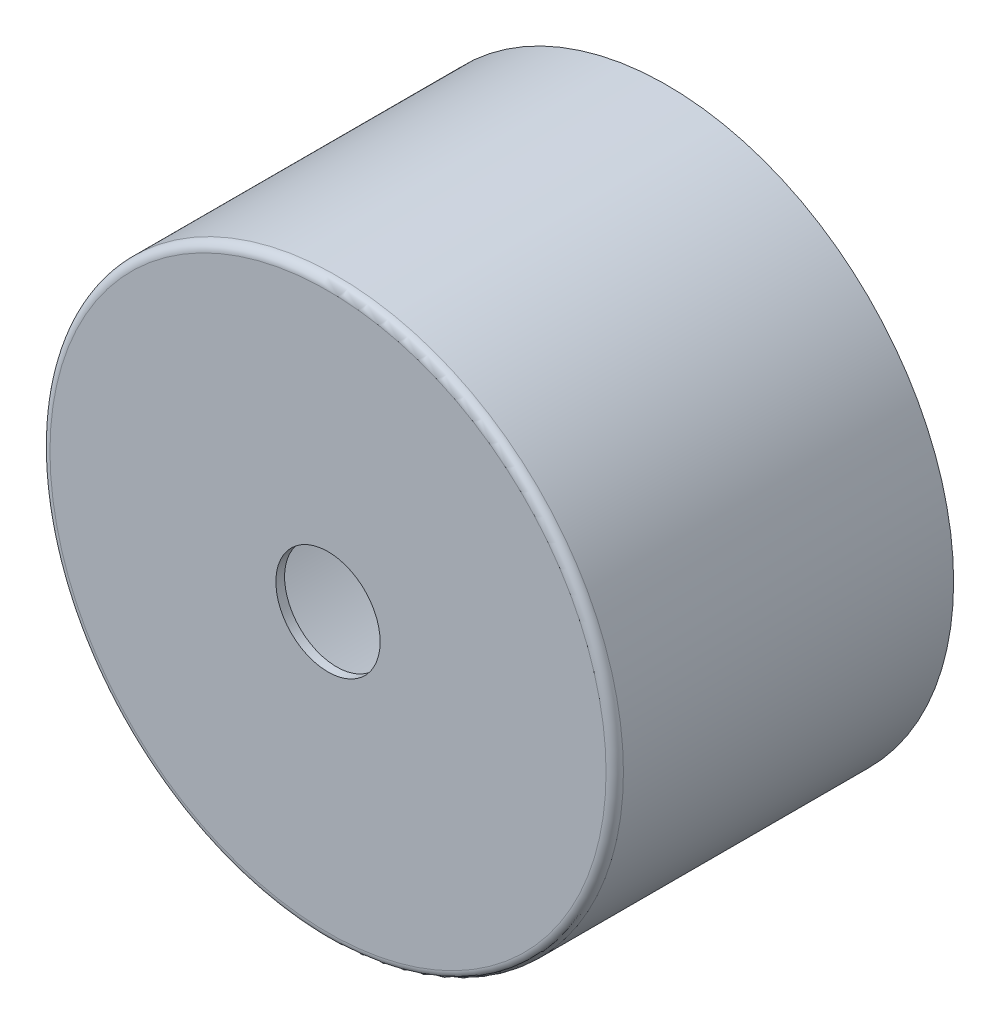
ISO-10303-21;
HEADER;
FILE_DESCRIPTION(('STEP AP214'),'2;1');
FILE_NAME('part.step','',(''),(''),'','','');
FILE_SCHEMA(('AUTOMOTIVE_DESIGN { 1 0 10303 214 1 1 1 1 }'));
ENDSEC;
DATA;
#1=APPLICATION_CONTEXT('core data for automotive mechanical design processes');
#2=APPLICATION_PROTOCOL_DEFINITION('international standard','automotive_design',2000,#1);
#3=PRODUCT_CONTEXT('',#1,'mechanical');
#4=PRODUCT('Part','Part','',(#3));
#5=PRODUCT_RELATED_PRODUCT_CATEGORY('part','',(#4));
#6=PRODUCT_DEFINITION_FORMATION('','',#4);
#7=PRODUCT_DEFINITION_CONTEXT('part definition',#1,'design');
#8=PRODUCT_DEFINITION('design','',#6,#7);
#9=PRODUCT_DEFINITION_SHAPE('','',#8);
#10=(LENGTH_UNIT() NAMED_UNIT(*) SI_UNIT(.MILLI.,.METRE.));
#11=(NAMED_UNIT(*) PLANE_ANGLE_UNIT() SI_UNIT($,.RADIAN.));
#12=(NAMED_UNIT(*) SI_UNIT($,.STERADIAN.) SOLID_ANGLE_UNIT());
#13=UNCERTAINTY_MEASURE_WITH_UNIT(LENGTH_MEASURE(1.E-05),#10,'distance_accuracy_value','');
#14=(GEOMETRIC_REPRESENTATION_CONTEXT(3) GLOBAL_UNCERTAINTY_ASSIGNED_CONTEXT((#13)) GLOBAL_UNIT_ASSIGNED_CONTEXT((#10,
#11,#12)) REPRESENTATION_CONTEXT('',''));
#15=CARTESIAN_POINT('',(0.,0.,0.));
#16=DIRECTION('',(0.,0.,1.));
#17=DIRECTION('',(1.,0.,0.));
#18=AXIS2_PLACEMENT_3D('',#15,#16,#17);
#19=CARTESIAN_POINT('',(0.,0.,-19.5));
#20=DIRECTION('',(0.,0.,1.));
#21=DIRECTION('',(1.,0.,0.));
#22=AXIS2_PLACEMENT_3D('',#19,#20,#21);
#23=CYLINDRICAL_SURFACE('',#22,16.5);
#24=CARTESIAN_POINT('',(0.,0.,-0.5));
#25=DIRECTION('',(0.,0.,1.));
#26=DIRECTION('',(1.,0.,0.));
#27=AXIS2_PLACEMENT_3D('',#24,#25,#26);
#28=CIRCLE('',#27,16.5);
#29=CARTESIAN_POINT('',(16.5,0.,-0.5));
#30=VERTEX_POINT('',#29);
#31=EDGE_CURVE('E10',#30,#30,#28,.F.);
#32=ORIENTED_EDGE('',*,*,#31,.T.);
#33=EDGE_LOOP('',(#32));
#34=FACE_BOUND('',#33,.T.);
#35=CARTESIAN_POINT('',(0.,0.,-19.5));
#36=DIRECTION('',(0.,0.,1.));
#37=DIRECTION('',(1.,0.,0.));
#38=AXIS2_PLACEMENT_3D('',#35,#36,#37);
#39=CIRCLE('',#38,16.5);
#40=CARTESIAN_POINT('',(16.5,0.,-19.5));
#41=VERTEX_POINT('',#40);
#42=EDGE_CURVE('E41',#41,#41,#39,.T.);
#43=ORIENTED_EDGE('',*,*,#42,.T.);
#44=EDGE_LOOP('',(#43));
#45=FACE_BOUND('',#44,.T.);
#46=ADVANCED_FACE('F30',(#34,#45),#23,.T.);
#47=CARTESIAN_POINT('',(0.,0.,-19.5));
#48=DIRECTION('',(0.,0.,1.));
#49=DIRECTION('',(1.,0.,0.));
#50=AXIS2_PLACEMENT_3D('',#47,#48,#49);
#51=PLANE('',#50);
#52=CARTESIAN_POINT('',(0.,0.,-19.5));
#53=DIRECTION('',(0.,0.,1.));
#54=DIRECTION('',(1.,0.,0.));
#55=AXIS2_PLACEMENT_3D('',#52,#53,#54);
#56=CIRCLE('',#55,16.);
#57=CARTESIAN_POINT('',(16.,0.,-19.5));
#58=VERTEX_POINT('',#57);
#59=EDGE_CURVE('E45',#58,#58,#56,.T.);
#60=ORIENTED_EDGE('',*,*,#59,.T.);
#61=EDGE_LOOP('',(#60));
#62=FACE_BOUND('',#61,.T.);
#63=ORIENTED_EDGE('',*,*,#42,.F.);
#64=EDGE_LOOP('',(#63));
#65=FACE_BOUND('',#64,.T.);
#66=ADVANCED_FACE('F66',(#62,#65),#51,.F.);
#67=CARTESIAN_POINT('',(0.,0.,0.));
#68=DIRECTION('',(0.,0.,1.));
#69=DIRECTION('',(1.,0.,0.));
#70=AXIS2_PLACEMENT_3D('',#67,#68,#69);
#71=PLANE('',#70);
#72=CARTESIAN_POINT('',(0.,0.,0.));
#73=DIRECTION('',(0.,0.,1.));
#74=DIRECTION('',(1.,0.,0.));
#75=AXIS2_PLACEMENT_3D('',#72,#73,#74);
#76=CIRCLE('',#75,16.);
#77=CARTESIAN_POINT('',(16.,0.,0.));
#78=VERTEX_POINT('',#77);
#79=EDGE_CURVE('E37',#78,#78,#76,.T.);
#80=ORIENTED_EDGE('',*,*,#79,.T.);
#81=EDGE_LOOP('',(#80));
#82=FACE_BOUND('',#81,.T.);
#83=CARTESIAN_POINT('',(0.,0.,0.));
#84=DIRECTION('',(0.,0.,1.));
#85=DIRECTION('',(1.,0.,0.));
#86=AXIS2_PLACEMENT_3D('',#83,#84,#85);
#87=CIRCLE('',#86,3.);
#88=CARTESIAN_POINT('',(3.,0.,0.));
#89=VERTEX_POINT('',#88);
#90=EDGE_CURVE('E51',#89,#89,#87,.T.);
#91=ORIENTED_EDGE('',*,*,#90,.F.);
#92=EDGE_LOOP('',(#91));
#93=FACE_BOUND('',#92,.T.);
#94=ADVANCED_FACE('F63',(#82,#93),#71,.T.);
#95=CARTESIAN_POINT('',(0.,0.,-19.5));
#96=DIRECTION('',(0.,0.,1.));
#97=DIRECTION('',(1.,0.,0.));
#98=AXIS2_PLACEMENT_3D('',#95,#96,#97);
#99=CYLINDRICAL_SURFACE('',#98,16.);
#100=ORIENTED_EDGE('',*,*,#59,.F.);
#101=EDGE_LOOP('',(#100));
#102=FACE_BOUND('',#101,.T.);
#103=CARTESIAN_POINT('',(0.,0.,-0.5));
#104=DIRECTION('',(0.,0.,1.));
#105=DIRECTION('',(1.,0.,0.));
#106=AXIS2_PLACEMENT_3D('',#103,#104,#105);
#107=CIRCLE('',#106,16.);
#108=CARTESIAN_POINT('',(16.,0.,-0.5));
#109=VERTEX_POINT('',#108);
#110=EDGE_CURVE('E50',#109,#109,#107,.T.);
#111=ORIENTED_EDGE('',*,*,#110,.T.);
#112=EDGE_LOOP('',(#111));
#113=FACE_BOUND('',#112,.T.);
#114=ADVANCED_FACE('F65',(#102,#113),#99,.F.);
#115=CARTESIAN_POINT('',(0.,0.,-0.5));
#116=DIRECTION('',(0.,0.,1.));
#117=DIRECTION('',(1.,0.,0.));
#118=AXIS2_PLACEMENT_3D('',#115,#116,#117);
#119=PLANE('',#118);
#120=CARTESIAN_POINT('',(0.,0.,-0.5));
#121=DIRECTION('',(0.,0.,1.));
#122=DIRECTION('',(1.,0.,0.));
#123=AXIS2_PLACEMENT_3D('',#120,#121,#122);
#124=CIRCLE('',#123,3.);
#125=CARTESIAN_POINT('',(3.,0.,-0.5));
#126=VERTEX_POINT('',#125);
#127=EDGE_CURVE('E48',#126,#126,#124,.T.);
#128=ORIENTED_EDGE('',*,*,#127,.T.);
#129=EDGE_LOOP('',(#128));
#130=FACE_BOUND('',#129,.T.);
#131=ORIENTED_EDGE('',*,*,#110,.F.);
#132=EDGE_LOOP('',(#131));
#133=FACE_BOUND('',#132,.T.);
#134=ADVANCED_FACE('F72',(#130,#133),#119,.F.);
#135=CARTESIAN_POINT('',(0.,0.,-19.5));
#136=DIRECTION('',(0.,0.,1.));
#137=DIRECTION('',(1.,0.,0.));
#138=AXIS2_PLACEMENT_3D('',#135,#136,#137);
#139=CYLINDRICAL_SURFACE('',#138,3.);
#140=ORIENTED_EDGE('',*,*,#90,.T.);
#141=EDGE_LOOP('',(#140));
#142=FACE_BOUND('',#141,.T.);
#143=ORIENTED_EDGE('',*,*,#127,.F.);
#144=EDGE_LOOP('',(#143));
#145=FACE_BOUND('',#144,.T.);
#146=ADVANCED_FACE('F60',(#142,#145),#139,.F.);
#147=CARTESIAN_POINT('',(0.,0.,-0.5));
#148=DIRECTION('',(0.,0.,1.));
#149=DIRECTION('',(1.,0.,0.));
#150=AXIS2_PLACEMENT_3D('',#147,#148,#149);
#151=TOROIDAL_SURFACE('',#150,16.,0.5);
#152=ORIENTED_EDGE('',*,*,#31,.F.);
#153=EDGE_LOOP('',(#152));
#154=FACE_BOUND('',#153,.T.);
#155=ORIENTED_EDGE('',*,*,#79,.F.);
#156=EDGE_LOOP('',(#155));
#157=FACE_BOUND('',#156,.T.);
#158=ADVANCED_FACE('F32',(#154,#157),#151,.T.);
#159=CLOSED_SHELL('',(#46,#66,#94,#114,#134,#146,#158));
#160=MANIFOLD_SOLID_BREP('B2',#159);
#161=ADVANCED_BREP_SHAPE_REPRESENTATION('',(#18,#160),#14);
#162=SHAPE_DEFINITION_REPRESENTATION(#9,#161);
ENDSEC;
END-ISO-10303-21;
